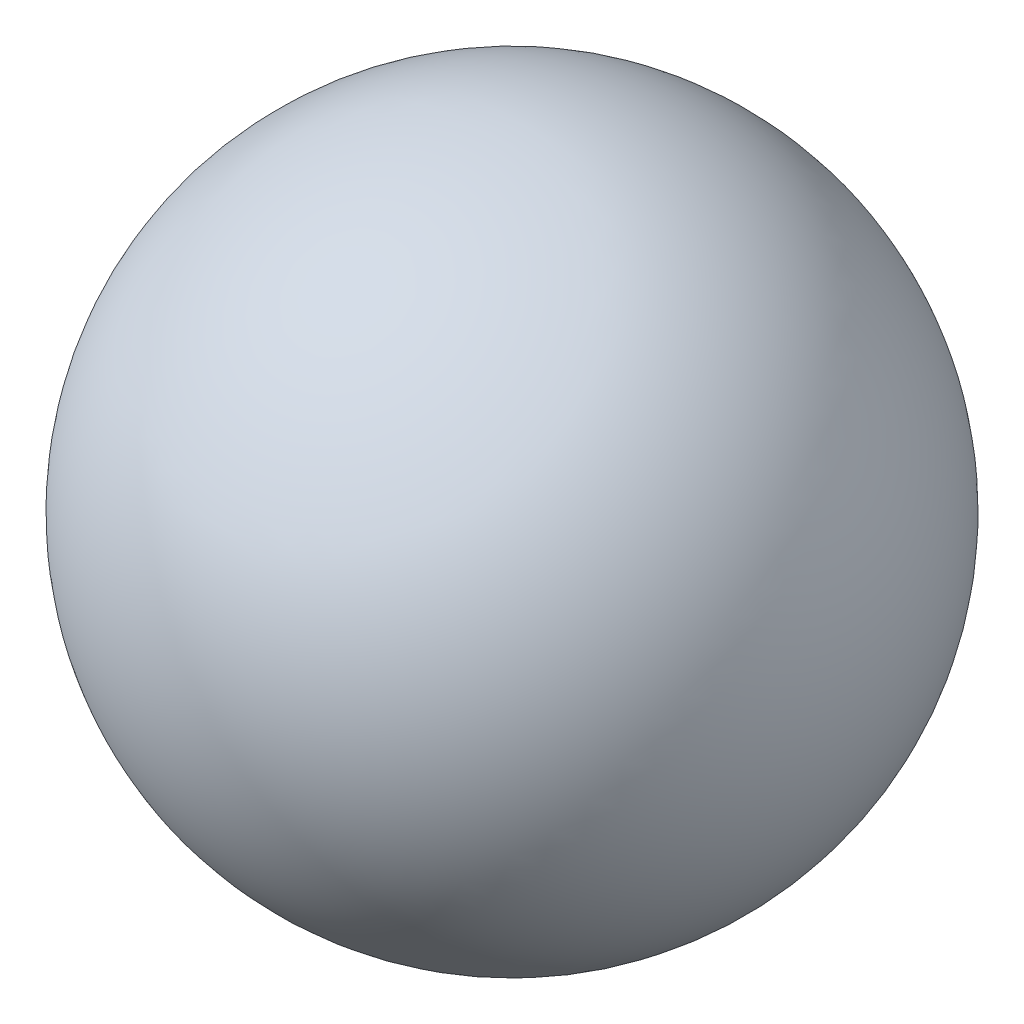
ISO-10303-21;
HEADER;
FILE_DESCRIPTION(('STEP AP214'),'2;1');
FILE_NAME('part.step','',(''),(''),'','','');
FILE_SCHEMA(('AUTOMOTIVE_DESIGN { 1 0 10303 214 1 1 1 1 }'));
ENDSEC;
DATA;
#1=APPLICATION_CONTEXT('core data for automotive mechanical design processes');
#2=APPLICATION_PROTOCOL_DEFINITION('international standard','automotive_design',2000,#1);
#3=PRODUCT_CONTEXT('',#1,'mechanical');
#4=PRODUCT('Part','Part','',(#3));
#5=PRODUCT_RELATED_PRODUCT_CATEGORY('part','',(#4));
#6=PRODUCT_DEFINITION_FORMATION('','',#4);
#7=PRODUCT_DEFINITION_CONTEXT('part definition',#1,'design');
#8=PRODUCT_DEFINITION('design','',#6,#7);
#9=PRODUCT_DEFINITION_SHAPE('','',#8);
#10=(LENGTH_UNIT() NAMED_UNIT(*) SI_UNIT(.MILLI.,.METRE.));
#11=(NAMED_UNIT(*) PLANE_ANGLE_UNIT() SI_UNIT($,.RADIAN.));
#12=(NAMED_UNIT(*) SI_UNIT($,.STERADIAN.) SOLID_ANGLE_UNIT());
#13=UNCERTAINTY_MEASURE_WITH_UNIT(LENGTH_MEASURE(1.E-05),#10,'distance_accuracy_value','');
#14=(GEOMETRIC_REPRESENTATION_CONTEXT(3) GLOBAL_UNCERTAINTY_ASSIGNED_CONTEXT((#13)) GLOBAL_UNIT_ASSIGNED_CONTEXT((#10,
#11,#12)) REPRESENTATION_CONTEXT('',''));
#15=CARTESIAN_POINT('',(0.,0.,0.));
#16=DIRECTION('',(0.,0.,1.));
#17=DIRECTION('',(1.,0.,0.));
#18=AXIS2_PLACEMENT_3D('',#15,#16,#17);
#19=CARTESIAN_POINT('',(-8.10842838491481,-2.,8.50387494773458));
#20=DIRECTION('',(0.,0.,1.));
#21=DIRECTION('',(1.,0.,0.));
#22=AXIS2_PLACEMENT_3D('',#19,#20,#21);
#23=SPHERICAL_SURFACE('',#22,1.05);
#24=CARTESIAN_POINT('',(-8.10842838491481,-2.,9.55387494773458));
#25=VERTEX_POINT('',#24);
#26=VERTEX_LOOP('',#25);
#27=FACE_BOUND('',#26,.T.);
#28=ADVANCED_FACE('F13',(#27),#23,.T.);
#29=CLOSED_SHELL('',(#28));
#30=MANIFOLD_SOLID_BREP('B1',#29);
#31=ADVANCED_BREP_SHAPE_REPRESENTATION('',(#18,#30),#14);
#32=SHAPE_DEFINITION_REPRESENTATION(#9,#31);
ENDSEC;
END-ISO-10303-21;
